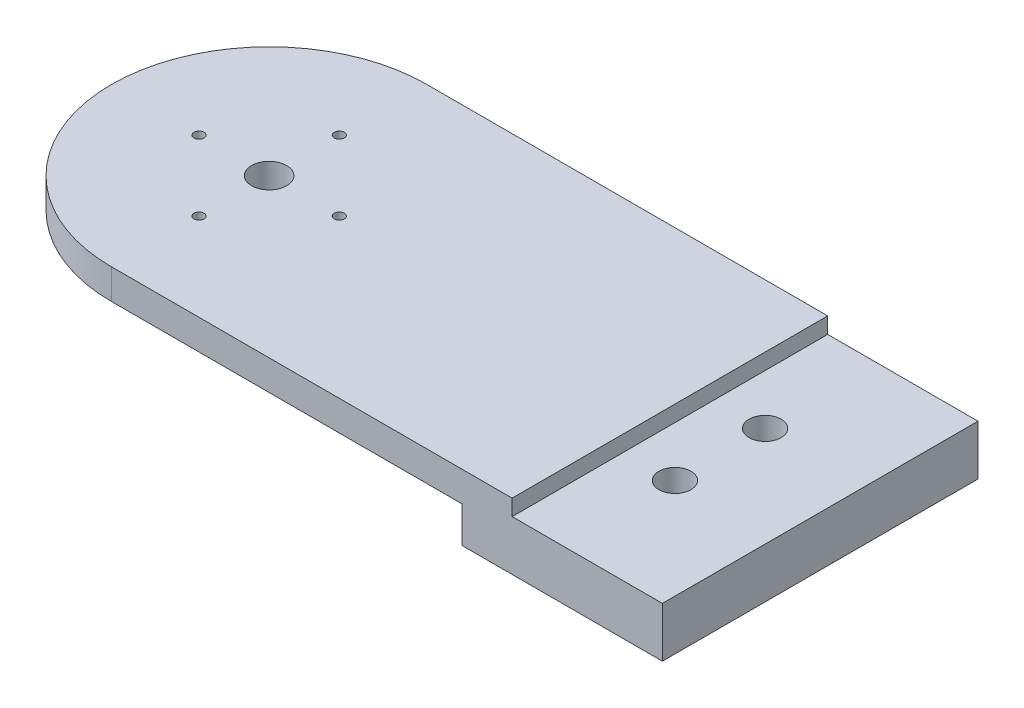
ISO-10303-21;
HEADER;
FILE_DESCRIPTION(('STEP AP214'),'2;1');
FILE_NAME('part.step','',(''),(''),'','','');
FILE_SCHEMA(('AUTOMOTIVE_DESIGN { 1 0 10303 214 1 1 1 1 }'));
ENDSEC;
DATA;
#1=APPLICATION_CONTEXT('core data for automotive mechanical design processes');
#2=APPLICATION_PROTOCOL_DEFINITION('international standard','automotive_design',2000,#1);
#3=PRODUCT_CONTEXT('',#1,'mechanical');
#4=PRODUCT('Part','Part','',(#3));
#5=PRODUCT_RELATED_PRODUCT_CATEGORY('part','',(#4));
#6=PRODUCT_DEFINITION_FORMATION('','',#4);
#7=PRODUCT_DEFINITION_CONTEXT('part definition',#1,'design');
#8=PRODUCT_DEFINITION('design','',#6,#7);
#9=PRODUCT_DEFINITION_SHAPE('','',#8);
#10=(LENGTH_UNIT() NAMED_UNIT(*) SI_UNIT(.MILLI.,.METRE.));
#11=(NAMED_UNIT(*) PLANE_ANGLE_UNIT() SI_UNIT($,.RADIAN.));
#12=(NAMED_UNIT(*) SI_UNIT($,.STERADIAN.) SOLID_ANGLE_UNIT());
#13=UNCERTAINTY_MEASURE_WITH_UNIT(LENGTH_MEASURE(1.E-05),#10,'distance_accuracy_value','');
#14=(GEOMETRIC_REPRESENTATION_CONTEXT(3) GLOBAL_UNCERTAINTY_ASSIGNED_CONTEXT((#13)) GLOBAL_UNIT_ASSIGNED_CONTEXT((#10,
#11,#12)) REPRESENTATION_CONTEXT('',''));
#15=CARTESIAN_POINT('',(0.,0.,0.));
#16=DIRECTION('',(0.,0.,1.));
#17=DIRECTION('',(1.,0.,0.));
#18=AXIS2_PLACEMENT_3D('',#15,#16,#17);
#19=CARTESIAN_POINT('',(0.,3.,0.));
#20=DIRECTION('',(0.,-1.,0.));
#21=DIRECTION('',(0.,0.,-1.));
#22=AXIS2_PLACEMENT_3D('',#19,#20,#21);
#23=CYLINDRICAL_SURFACE('',#22,15.75);
#24=CARTESIAN_POINT('',(0.,1.6,0.));
#25=DIRECTION('',(0.,-1.,0.));
#26=DIRECTION('',(0.,0.,-1.));
#27=AXIS2_PLACEMENT_3D('',#24,#25,#26);
#28=CIRCLE('',#27,15.75);
#29=CARTESIAN_POINT('',(0.,1.6,15.75));
#30=VERTEX_POINT('',#29);
#31=CARTESIAN_POINT('',(0.,1.6,-15.75));
#32=VERTEX_POINT('',#31);
#33=EDGE_CURVE('E146',#30,#32,#28,.T.);
#34=ORIENTED_EDGE('',*,*,#33,.F.);
#35=DIRECTION('',(0.,-1.,0.));
#36=VECTOR('',#35,1.);
#37=CARTESIAN_POINT('',(0.,3.,15.75));
#38=LINE('',#37,#36);
#39=CARTESIAN_POINT('',(0.,4.6,15.75));
#40=VERTEX_POINT('',#39);
#41=EDGE_CURVE('E11',#40,#30,#38,.T.);
#42=ORIENTED_EDGE('',*,*,#41,.F.);
#43=CARTESIAN_POINT('',(0.,4.6,0.));
#44=DIRECTION('',(0.,-1.,0.));
#45=DIRECTION('',(0.,0.,-1.));
#46=AXIS2_PLACEMENT_3D('',#43,#44,#45);
#47=CIRCLE('',#46,15.75);
#48=CARTESIAN_POINT('',(0.,4.6,-15.75));
#49=VERTEX_POINT('',#48);
#50=EDGE_CURVE('E115',#40,#49,#47,.T.);
#51=ORIENTED_EDGE('',*,*,#50,.T.);
#52=DIRECTION('',(0.,-1.,0.));
#53=VECTOR('',#52,1.);
#54=CARTESIAN_POINT('',(0.,3.,-15.75));
#55=LINE('',#54,#53);
#56=EDGE_CURVE('E109',#49,#32,#55,.T.);
#57=ORIENTED_EDGE('',*,*,#56,.T.);
#58=EDGE_LOOP('',(#34,#42,#51,#57));
#59=FACE_BOUND('',#58,.T.);
#60=ADVANCED_FACE('F39',(#59),#23,.T.);
#61=CARTESIAN_POINT('',(0.,3.,15.75));
#62=DIRECTION('',(0.,0.,-1.));
#63=DIRECTION('',(-1.,0.,0.));
#64=AXIS2_PLACEMENT_3D('',#61,#62,#63);
#65=PLANE('',#64);
#66=DIRECTION('',(1.,0.,0.));
#67=VECTOR('',#66,1.);
#68=CARTESIAN_POINT('',(0.,3.,15.75));
#69=LINE('',#68,#67);
#70=CARTESIAN_POINT('',(40.,3.,15.75));
#71=VERTEX_POINT('',#70);
#72=CARTESIAN_POINT('',(55.,3.,15.75));
#73=VERTEX_POINT('',#72);
#74=EDGE_CURVE('E175',#71,#73,#69,.T.);
#75=ORIENTED_EDGE('',*,*,#74,.F.);
#76=DIRECTION('',(0.,-1.,0.));
#77=VECTOR('',#76,1.);
#78=CARTESIAN_POINT('',(40.,4.6,15.75));
#79=LINE('',#78,#77);
#80=CARTESIAN_POINT('',(40.,4.6,15.75));
#81=VERTEX_POINT('',#80);
#82=EDGE_CURVE('E223',#81,#71,#79,.T.);
#83=ORIENTED_EDGE('',*,*,#82,.F.);
#84=DIRECTION('',(-1.,0.,0.));
#85=VECTOR('',#84,1.);
#86=CARTESIAN_POINT('',(35.,4.6,15.75));
#87=LINE('',#86,#85);
#88=EDGE_CURVE('E114',#81,#40,#87,.T.);
#89=ORIENTED_EDGE('',*,*,#88,.T.);
#90=ORIENTED_EDGE('',*,*,#41,.T.);
#91=DIRECTION('',(-1.,0.,0.));
#92=VECTOR('',#91,1.);
#93=CARTESIAN_POINT('',(35.,1.6,15.75));
#94=LINE('',#93,#92);
#95=CARTESIAN_POINT('',(35.,1.6,15.75));
#96=VERTEX_POINT('',#95);
#97=EDGE_CURVE('E144',#96,#30,#94,.T.);
#98=ORIENTED_EDGE('',*,*,#97,.F.);
#99=DIRECTION('',(0.,1.,0.));
#100=VECTOR('',#99,1.);
#101=CARTESIAN_POINT('',(35.,-2.,15.75));
#102=LINE('',#101,#100);
#103=CARTESIAN_POINT('',(35.,-2.,15.75));
#104=VERTEX_POINT('',#103);
#105=EDGE_CURVE('E171',#104,#96,#102,.T.);
#106=ORIENTED_EDGE('',*,*,#105,.F.);
#107=DIRECTION('',(-1.,0.,0.));
#108=VECTOR('',#107,1.);
#109=CARTESIAN_POINT('',(35.,-2.,15.75));
#110=LINE('',#109,#108);
#111=CARTESIAN_POINT('',(55.,-2.,15.75));
#112=VERTEX_POINT('',#111);
#113=EDGE_CURVE('E169',#112,#104,#110,.T.);
#114=ORIENTED_EDGE('',*,*,#113,.F.);
#115=DIRECTION('',(0.,-1.,0.));
#116=VECTOR('',#115,1.);
#117=CARTESIAN_POINT('',(55.,3.,15.75));
#118=LINE('',#117,#116);
#119=EDGE_CURVE('E47',#73,#112,#118,.T.);
#120=ORIENTED_EDGE('',*,*,#119,.F.);
#121=EDGE_LOOP('',(#75,#83,#89,#90,#98,#106,#114,#120));
#122=FACE_BOUND('',#121,.T.);
#123=ADVANCED_FACE('F225',(#122),#65,.F.);
#124=CARTESIAN_POINT('',(55.,3.,15.75));
#125=DIRECTION('',(-1.,0.,0.));
#126=DIRECTION('',(0.,0.,1.));
#127=AXIS2_PLACEMENT_3D('',#124,#125,#126);
#128=PLANE('',#127);
#129=ORIENTED_EDGE('',*,*,#119,.T.);
#130=DIRECTION('',(0.,0.,1.));
#131=VECTOR('',#130,1.);
#132=CARTESIAN_POINT('',(55.,-2.,15.75));
#133=LINE('',#132,#131);
#134=CARTESIAN_POINT('',(55.,-2.,-15.75));
#135=VERTEX_POINT('',#134);
#136=EDGE_CURVE('E166',#135,#112,#133,.T.);
#137=ORIENTED_EDGE('',*,*,#136,.F.);
#138=DIRECTION('',(0.,-1.,0.));
#139=VECTOR('',#138,1.);
#140=CARTESIAN_POINT('',(55.,3.,-15.75));
#141=LINE('',#140,#139);
#142=CARTESIAN_POINT('',(55.,3.,-15.75));
#143=VERTEX_POINT('',#142);
#144=EDGE_CURVE('E181',#143,#135,#141,.T.);
#145=ORIENTED_EDGE('',*,*,#144,.F.);
#146=DIRECTION('',(0.,0.,-1.));
#147=VECTOR('',#146,1.);
#148=CARTESIAN_POINT('',(55.,3.,15.75));
#149=LINE('',#148,#147);
#150=EDGE_CURVE('E177',#73,#143,#149,.T.);
#151=ORIENTED_EDGE('',*,*,#150,.F.);
#152=EDGE_LOOP('',(#129,#137,#145,#151));
#153=FACE_BOUND('',#152,.T.);
#154=ADVANCED_FACE('F234',(#153),#128,.F.);
#155=CARTESIAN_POINT('',(55.,3.,-15.75));
#156=DIRECTION('',(0.,0.,1.));
#157=DIRECTION('',(1.,0.,0.));
#158=AXIS2_PLACEMENT_3D('',#155,#156,#157);
#159=PLANE('',#158);
#160=DIRECTION('',(0.,1.,0.));
#161=VECTOR('',#160,1.);
#162=CARTESIAN_POINT('',(35.,-2.,-15.75));
#163=LINE('',#162,#161);
#164=CARTESIAN_POINT('',(35.,-2.,-15.75));
#165=VERTEX_POINT('',#164);
#166=CARTESIAN_POINT('',(35.,1.6,-15.75));
#167=VERTEX_POINT('',#166);
#168=EDGE_CURVE('E173',#165,#167,#163,.T.);
#169=ORIENTED_EDGE('',*,*,#168,.T.);
#170=DIRECTION('',(1.,0.,0.));
#171=VECTOR('',#170,1.);
#172=CARTESIAN_POINT('',(0.,1.6,-15.75));
#173=LINE('',#172,#171);
#174=EDGE_CURVE('E138',#32,#167,#173,.T.);
#175=ORIENTED_EDGE('',*,*,#174,.F.);
#176=ORIENTED_EDGE('',*,*,#56,.F.);
#177=DIRECTION('',(1.,0.,0.));
#178=VECTOR('',#177,1.);
#179=CARTESIAN_POINT('',(0.,4.6,-15.75));
#180=LINE('',#179,#178);
#181=CARTESIAN_POINT('',(40.,4.6,-15.75));
#182=VERTEX_POINT('',#181);
#183=EDGE_CURVE('E103',#49,#182,#180,.T.);
#184=ORIENTED_EDGE('',*,*,#183,.T.);
#185=DIRECTION('',(0.,1.,0.));
#186=VECTOR('',#185,1.);
#187=CARTESIAN_POINT('',(40.,4.6,-15.75));
#188=LINE('',#187,#186);
#189=CARTESIAN_POINT('',(40.,3.,-15.75));
#190=VERTEX_POINT('',#189);
#191=EDGE_CURVE('E106',#190,#182,#188,.T.);
#192=ORIENTED_EDGE('',*,*,#191,.F.);
#193=DIRECTION('',(-1.,0.,0.));
#194=VECTOR('',#193,1.);
#195=CARTESIAN_POINT('',(55.,3.,-15.75));
#196=LINE('',#195,#194);
#197=EDGE_CURVE('E55',#143,#190,#196,.T.);
#198=ORIENTED_EDGE('',*,*,#197,.F.);
#199=ORIENTED_EDGE('',*,*,#144,.T.);
#200=DIRECTION('',(1.,0.,0.));
#201=VECTOR('',#200,1.);
#202=CARTESIAN_POINT('',(35.,-2.,-15.75));
#203=LINE('',#202,#201);
#204=EDGE_CURVE('E163',#165,#135,#203,.T.);
#205=ORIENTED_EDGE('',*,*,#204,.F.);
#206=EDGE_LOOP('',(#169,#175,#176,#184,#192,#198,#199,#205));
#207=FACE_BOUND('',#206,.T.);
#208=ADVANCED_FACE('F105',(#207),#159,.F.);
#209=CARTESIAN_POINT('',(0.,3.,0.));
#210=DIRECTION('',(0.,1.,0.));
#211=DIRECTION('',(0.,0.,1.));
#212=AXIS2_PLACEMENT_3D('',#209,#210,#211);
#213=PLANE('',#212);
#214=DIRECTION('',(0.,0.,-1.));
#215=VECTOR('',#214,1.);
#216=CARTESIAN_POINT('',(40.,3.,15.75));
#217=LINE('',#216,#215);
#218=EDGE_CURVE('E59',#71,#190,#217,.T.);
#219=ORIENTED_EDGE('',*,*,#218,.F.);
#220=ORIENTED_EDGE('',*,*,#74,.T.);
#221=ORIENTED_EDGE('',*,*,#150,.T.);
#222=ORIENTED_EDGE('',*,*,#197,.T.);
#223=EDGE_LOOP('',(#219,#220,#221,#222));
#224=FACE_BOUND('',#223,.T.);
#225=CARTESIAN_POINT('',(45.0000000000004,3.,-4.49999999999967));
#226=DIRECTION('',(0.,1.,0.));
#227=DIRECTION('',(0.,0.,1.));
#228=AXIS2_PLACEMENT_3D('',#225,#226,#227);
#229=CIRCLE('',#228,1.5999999999998);
#230=CARTESIAN_POINT('',(45.0000000000004,3.,-2.89999999999987));
#231=VERTEX_POINT('',#230);
#232=EDGE_CURVE('E157',#231,#231,#229,.T.);
#233=ORIENTED_EDGE('',*,*,#232,.F.);
#234=EDGE_LOOP('',(#233));
#235=FACE_BOUND('',#234,.T.);
#236=CARTESIAN_POINT('',(45.0000000000004,3.,4.49999999999966));
#237=DIRECTION('',(0.,1.,0.));
#238=DIRECTION('',(0.,0.,1.));
#239=AXIS2_PLACEMENT_3D('',#236,#237,#238);
#240=CIRCLE('',#239,1.6);
#241=CARTESIAN_POINT('',(45.0000000000004,3.,6.09999999999966));
#242=VERTEX_POINT('',#241);
#243=EDGE_CURVE('E152',#242,#242,#240,.T.);
#244=ORIENTED_EDGE('',*,*,#243,.F.);
#245=EDGE_LOOP('',(#244));
#246=FACE_BOUND('',#245,.T.);
#247=ADVANCED_FACE('F229',(#224,#235,#246),#213,.T.);
#248=CARTESIAN_POINT('',(35.,-2.,15.75));
#249=DIRECTION('',(1.,0.,0.));
#250=DIRECTION('',(0.,0.,-1.));
#251=AXIS2_PLACEMENT_3D('',#248,#249,#250);
#252=PLANE('',#251);
#253=ORIENTED_EDGE('',*,*,#105,.T.);
#254=DIRECTION('',(0.,0.,1.));
#255=VECTOR('',#254,1.);
#256=CARTESIAN_POINT('',(35.,1.6,-15.75));
#257=LINE('',#256,#255);
#258=EDGE_CURVE('E141',#167,#96,#257,.T.);
#259=ORIENTED_EDGE('',*,*,#258,.F.);
#260=ORIENTED_EDGE('',*,*,#168,.F.);
#261=DIRECTION('',(0.,0.,-1.));
#262=VECTOR('',#261,1.);
#263=CARTESIAN_POINT('',(35.,-2.,15.75));
#264=LINE('',#263,#262);
#265=EDGE_CURVE('E160',#104,#165,#264,.T.);
#266=ORIENTED_EDGE('',*,*,#265,.F.);
#267=EDGE_LOOP('',(#253,#259,#260,#266));
#268=FACE_BOUND('',#267,.T.);
#269=ADVANCED_FACE('F242',(#268),#252,.F.);
#270=CARTESIAN_POINT('',(0.,-2.,0.));
#271=DIRECTION('',(0.,-1.,0.));
#272=DIRECTION('',(0.,0.,-1.));
#273=AXIS2_PLACEMENT_3D('',#270,#271,#272);
#274=PLANE('',#273);
#275=CARTESIAN_POINT('',(45.0000000000004,-2.,-4.49999999999967));
#276=DIRECTION('',(0.,-1.,0.));
#277=DIRECTION('',(0.,0.,-1.));
#278=AXIS2_PLACEMENT_3D('',#275,#276,#277);
#279=CIRCLE('',#278,1.5999999999998);
#280=CARTESIAN_POINT('',(45.0000000000004,-2.,-6.09999999999947));
#281=VERTEX_POINT('',#280);
#282=EDGE_CURVE('E149',#281,#281,#279,.T.);
#283=ORIENTED_EDGE('',*,*,#282,.F.);
#284=EDGE_LOOP('',(#283));
#285=FACE_BOUND('',#284,.T.);
#286=CARTESIAN_POINT('',(45.0000000000004,-2.,4.49999999999966));
#287=DIRECTION('',(0.,-1.,0.));
#288=DIRECTION('',(0.,0.,-1.));
#289=AXIS2_PLACEMENT_3D('',#286,#287,#288);
#290=CIRCLE('',#289,1.6);
#291=CARTESIAN_POINT('',(45.0000000000004,-2.,2.89999999999966));
#292=VERTEX_POINT('',#291);
#293=EDGE_CURVE('E148',#292,#292,#290,.T.);
#294=ORIENTED_EDGE('',*,*,#293,.F.);
#295=EDGE_LOOP('',(#294));
#296=FACE_BOUND('',#295,.T.);
#297=ORIENTED_EDGE('',*,*,#265,.T.);
#298=ORIENTED_EDGE('',*,*,#204,.T.);
#299=ORIENTED_EDGE('',*,*,#136,.T.);
#300=ORIENTED_EDGE('',*,*,#113,.T.);
#301=EDGE_LOOP('',(#297,#298,#299,#300));
#302=FACE_BOUND('',#301,.T.);
#303=ADVANCED_FACE('F236',(#285,#296,#302),#274,.T.);
#304=CARTESIAN_POINT('',(45.0000000000004,8.,4.49999999999966));
#305=DIRECTION('',(0.,-1.,0.));
#306=DIRECTION('',(0.,0.,-1.));
#307=AXIS2_PLACEMENT_3D('',#304,#305,#306);
#308=CYLINDRICAL_SURFACE('',#307,1.6);
#309=ORIENTED_EDGE('',*,*,#243,.T.);
#310=EDGE_LOOP('',(#309));
#311=FACE_BOUND('',#310,.T.);
#312=ORIENTED_EDGE('',*,*,#293,.T.);
#313=EDGE_LOOP('',(#312));
#314=FACE_BOUND('',#313,.T.);
#315=ADVANCED_FACE('F258',(#311,#314),#308,.F.);
#316=CARTESIAN_POINT('',(45.0000000000004,8.,-4.49999999999967));
#317=DIRECTION('',(0.,-1.,0.));
#318=DIRECTION('',(0.,0.,-1.));
#319=AXIS2_PLACEMENT_3D('',#316,#317,#318);
#320=CYLINDRICAL_SURFACE('',#319,1.5999999999998);
#321=ORIENTED_EDGE('',*,*,#232,.T.);
#322=EDGE_LOOP('',(#321));
#323=FACE_BOUND('',#322,.T.);
#324=ORIENTED_EDGE('',*,*,#282,.T.);
#325=EDGE_LOOP('',(#324));
#326=FACE_BOUND('',#325,.T.);
#327=ADVANCED_FACE('F249',(#323,#326),#320,.F.);
#328=CARTESIAN_POINT('',(0.,1.6,0.));
#329=DIRECTION('',(0.,-1.,0.));
#330=DIRECTION('',(0.,0.,-1.));
#331=AXIS2_PLACEMENT_3D('',#328,#329,#330);
#332=PLANE('',#331);
#333=CARTESIAN_POINT('',(0.,1.6,0.));
#334=DIRECTION('',(0.,-1.,0.));
#335=DIRECTION('',(0.,0.,-1.));
#336=AXIS2_PLACEMENT_3D('',#333,#334,#335);
#337=CIRCLE('',#336,10.);
#338=CARTESIAN_POINT('',(0.,1.6,-10.));
#339=VERTEX_POINT('',#338);
#340=EDGE_CURVE('E126',#339,#339,#337,.T.);
#341=ORIENTED_EDGE('',*,*,#340,.F.);
#342=EDGE_LOOP('',(#341));
#343=FACE_BOUND('',#342,.T.);
#344=ORIENTED_EDGE('',*,*,#174,.T.);
#345=ORIENTED_EDGE('',*,*,#258,.T.);
#346=ORIENTED_EDGE('',*,*,#97,.T.);
#347=ORIENTED_EDGE('',*,*,#33,.T.);
#348=EDGE_LOOP('',(#344,#345,#346,#347));
#349=FACE_BOUND('',#348,.T.);
#350=ADVANCED_FACE('F247',(#343,#349),#332,.T.);
#351=CARTESIAN_POINT('',(0.,4.6,0.));
#352=DIRECTION('',(0.,-1.,0.));
#353=DIRECTION('',(0.,0.,-1.));
#354=AXIS2_PLACEMENT_3D('',#351,#352,#353);
#355=PLANE('',#354);
#356=CARTESIAN_POINT('',(0.,4.6,7.));
#357=DIRECTION('',(0.,-1.,0.));
#358=DIRECTION('',(0.,0.,-1.));
#359=AXIS2_PLACEMENT_3D('',#356,#357,#358);
#360=CIRCLE('',#359,0.5);
#361=CARTESIAN_POINT('',(0.,4.6,6.5));
#362=VERTEX_POINT('',#361);
#363=EDGE_CURVE('E42',#362,#362,#360,.T.);
#364=ORIENTED_EDGE('',*,*,#363,.T.);
#365=EDGE_LOOP('',(#364));
#366=FACE_BOUND('',#365,.T.);
#367=CARTESIAN_POINT('',(7.,4.6,0.));
#368=DIRECTION('',(0.,-1.,0.));
#369=DIRECTION('',(0.,0.,-1.));
#370=AXIS2_PLACEMENT_3D('',#367,#368,#369);
#371=CIRCLE('',#370,0.5);
#372=CARTESIAN_POINT('',(7.,4.6,-0.5));
#373=VERTEX_POINT('',#372);
#374=EDGE_CURVE('E191',#373,#373,#371,.T.);
#375=ORIENTED_EDGE('',*,*,#374,.T.);
#376=EDGE_LOOP('',(#375));
#377=FACE_BOUND('',#376,.T.);
#378=CARTESIAN_POINT('',(0.,4.6,-7.));
#379=DIRECTION('',(0.,-1.,0.));
#380=DIRECTION('',(0.,0.,-1.));
#381=AXIS2_PLACEMENT_3D('',#378,#379,#380);
#382=CIRCLE('',#381,0.5);
#383=CARTESIAN_POINT('',(0.,4.6,-7.5));
#384=VERTEX_POINT('',#383);
#385=EDGE_CURVE('E189',#384,#384,#382,.T.);
#386=ORIENTED_EDGE('',*,*,#385,.T.);
#387=EDGE_LOOP('',(#386));
#388=FACE_BOUND('',#387,.T.);
#389=CARTESIAN_POINT('',(-7.,4.6,0.));
#390=DIRECTION('',(0.,-1.,0.));
#391=DIRECTION('',(0.,0.,-1.));
#392=AXIS2_PLACEMENT_3D('',#389,#390,#391);
#393=CIRCLE('',#392,0.500000000000001);
#394=CARTESIAN_POINT('',(-7.,4.6,-0.500000000000001));
#395=VERTEX_POINT('',#394);
#396=EDGE_CURVE('E186',#395,#395,#393,.T.);
#397=ORIENTED_EDGE('',*,*,#396,.T.);
#398=EDGE_LOOP('',(#397));
#399=FACE_BOUND('',#398,.T.);
#400=CARTESIAN_POINT('',(0.,4.6,0.));
#401=DIRECTION('',(0.,-1.,0.));
#402=DIRECTION('',(0.,0.,-1.));
#403=AXIS2_PLACEMENT_3D('',#400,#401,#402);
#404=CIRCLE('',#403,1.75);
#405=CARTESIAN_POINT('',(0.,4.6,-1.75));
#406=VERTEX_POINT('',#405);
#407=EDGE_CURVE('E134',#406,#406,#404,.T.);
#408=ORIENTED_EDGE('',*,*,#407,.T.);
#409=EDGE_LOOP('',(#408));
#410=FACE_BOUND('',#409,.T.);
#411=ORIENTED_EDGE('',*,*,#50,.F.);
#412=ORIENTED_EDGE('',*,*,#88,.F.);
#413=DIRECTION('',(0.,0.,1.));
#414=VECTOR('',#413,1.);
#415=CARTESIAN_POINT('',(40.,4.6,15.75));
#416=LINE('',#415,#414);
#417=EDGE_CURVE('E121',#182,#81,#416,.T.);
#418=ORIENTED_EDGE('',*,*,#417,.F.);
#419=ORIENTED_EDGE('',*,*,#183,.F.);
#420=EDGE_LOOP('',(#411,#412,#418,#419));
#421=FACE_BOUND('',#420,.T.);
#422=ADVANCED_FACE('F124',(#366,#377,#388,#399,#410,#421),#355,.F.);
#423=CARTESIAN_POINT('',(0.,11.6,0.));
#424=DIRECTION('',(0.,-1.,0.));
#425=DIRECTION('',(0.,0.,-1.));
#426=AXIS2_PLACEMENT_3D('',#423,#424,#425);
#427=CYLINDRICAL_SURFACE('',#426,1.75);
#428=ORIENTED_EDGE('',*,*,#407,.F.);
#429=EDGE_LOOP('',(#428));
#430=FACE_BOUND('',#429,.T.);
#431=CARTESIAN_POINT('',(0.,0.,0.));
#432=DIRECTION('',(0.,-1.,0.));
#433=DIRECTION('',(0.,0.,-1.));
#434=AXIS2_PLACEMENT_3D('',#431,#432,#433);
#435=CIRCLE('',#434,1.75);
#436=CARTESIAN_POINT('',(0.,0.,-1.75));
#437=VERTEX_POINT('',#436);
#438=EDGE_CURVE('E219',#437,#437,#435,.T.);
#439=ORIENTED_EDGE('',*,*,#438,.T.);
#440=EDGE_LOOP('',(#439));
#441=FACE_BOUND('',#440,.T.);
#442=ADVANCED_FACE('F256',(#430,#441),#427,.F.);
#443=CARTESIAN_POINT('',(-7.,11.6,0.));
#444=DIRECTION('',(0.,-1.,0.));
#445=DIRECTION('',(0.,0.,-1.));
#446=AXIS2_PLACEMENT_3D('',#443,#444,#445);
#447=CYLINDRICAL_SURFACE('',#446,0.500000000000001);
#448=ORIENTED_EDGE('',*,*,#396,.F.);
#449=EDGE_LOOP('',(#448));
#450=FACE_BOUND('',#449,.T.);
#451=CARTESIAN_POINT('',(-7.,0.,0.));
#452=DIRECTION('',(0.,-1.,0.));
#453=DIRECTION('',(0.,0.,-1.));
#454=AXIS2_PLACEMENT_3D('',#451,#452,#453);
#455=CIRCLE('',#454,0.500000000000001);
#456=CARTESIAN_POINT('',(-7.,0.,-0.500000000000001));
#457=VERTEX_POINT('',#456);
#458=EDGE_CURVE('E210',#457,#457,#455,.T.);
#459=ORIENTED_EDGE('',*,*,#458,.T.);
#460=EDGE_LOOP('',(#459));
#461=FACE_BOUND('',#460,.T.);
#462=ADVANCED_FACE('F367',(#450,#461),#447,.F.);
#463=CARTESIAN_POINT('',(0.,11.6,-7.));
#464=DIRECTION('',(0.,-1.,0.));
#465=DIRECTION('',(0.,0.,-1.));
#466=AXIS2_PLACEMENT_3D('',#463,#464,#465);
#467=CYLINDRICAL_SURFACE('',#466,0.5);
#468=ORIENTED_EDGE('',*,*,#385,.F.);
#469=EDGE_LOOP('',(#468));
#470=FACE_BOUND('',#469,.T.);
#471=CARTESIAN_POINT('',(0.,0.,-7.));
#472=DIRECTION('',(0.,-1.,0.));
#473=DIRECTION('',(0.,0.,-1.));
#474=AXIS2_PLACEMENT_3D('',#471,#472,#473);
#475=CIRCLE('',#474,0.5);
#476=CARTESIAN_POINT('',(0.,0.,-7.5));
#477=VERTEX_POINT('',#476);
#478=EDGE_CURVE('E209',#477,#477,#475,.T.);
#479=ORIENTED_EDGE('',*,*,#478,.T.);
#480=EDGE_LOOP('',(#479));
#481=FACE_BOUND('',#480,.T.);
#482=ADVANCED_FACE('F378',(#470,#481),#467,.F.);
#483=CARTESIAN_POINT('',(7.,11.6,0.));
#484=DIRECTION('',(0.,-1.,0.));
#485=DIRECTION('',(0.,0.,-1.));
#486=AXIS2_PLACEMENT_3D('',#483,#484,#485);
#487=CYLINDRICAL_SURFACE('',#486,0.5);
#488=ORIENTED_EDGE('',*,*,#374,.F.);
#489=EDGE_LOOP('',(#488));
#490=FACE_BOUND('',#489,.T.);
#491=CARTESIAN_POINT('',(7.,0.,0.));
#492=DIRECTION('',(0.,-1.,0.));
#493=DIRECTION('',(0.,0.,-1.));
#494=AXIS2_PLACEMENT_3D('',#491,#492,#493);
#495=CIRCLE('',#494,0.500000000000001);
#496=CARTESIAN_POINT('',(7.,0.,-0.500000000000001));
#497=VERTEX_POINT('',#496);
#498=EDGE_CURVE('E213',#497,#497,#495,.T.);
#499=ORIENTED_EDGE('',*,*,#498,.T.);
#500=EDGE_LOOP('',(#499));
#501=FACE_BOUND('',#500,.T.);
#502=ADVANCED_FACE('F203',(#490,#501),#487,.F.);
#503=CARTESIAN_POINT('',(0.,11.6,7.));
#504=DIRECTION('',(0.,-1.,0.));
#505=DIRECTION('',(0.,0.,-1.));
#506=AXIS2_PLACEMENT_3D('',#503,#504,#505);
#507=CYLINDRICAL_SURFACE('',#506,0.5);
#508=ORIENTED_EDGE('',*,*,#363,.F.);
#509=EDGE_LOOP('',(#508));
#510=FACE_BOUND('',#509,.T.);
#511=CARTESIAN_POINT('',(0.,0.,7.));
#512=DIRECTION('',(0.,-1.,0.));
#513=DIRECTION('',(0.,0.,-1.));
#514=AXIS2_PLACEMENT_3D('',#511,#512,#513);
#515=CIRCLE('',#514,0.5);
#516=CARTESIAN_POINT('',(0.,0.,6.5));
#517=VERTEX_POINT('',#516);
#518=EDGE_CURVE('E207',#517,#517,#515,.T.);
#519=ORIENTED_EDGE('',*,*,#518,.T.);
#520=EDGE_LOOP('',(#519));
#521=FACE_BOUND('',#520,.T.);
#522=ADVANCED_FACE('F199',(#510,#521),#507,.F.);
#523=CARTESIAN_POINT('',(0.,0.,0.));
#524=DIRECTION('',(0.,1.,0.));
#525=DIRECTION('',(0.,0.,1.));
#526=AXIS2_PLACEMENT_3D('',#523,#524,#525);
#527=CYLINDRICAL_SURFACE('',#526,10.);
#528=CARTESIAN_POINT('',(0.,0.,0.));
#529=DIRECTION('',(0.,-1.,0.));
#530=DIRECTION('',(0.,0.,-1.));
#531=AXIS2_PLACEMENT_3D('',#528,#529,#530);
#532=CIRCLE('',#531,10.);
#533=CARTESIAN_POINT('',(0.,0.,-10.));
#534=VERTEX_POINT('',#533);
#535=EDGE_CURVE('E129',#534,#534,#532,.T.);
#536=ORIENTED_EDGE('',*,*,#535,.F.);
#537=EDGE_LOOP('',(#536));
#538=FACE_BOUND('',#537,.T.);
#539=ORIENTED_EDGE('',*,*,#340,.T.);
#540=EDGE_LOOP('',(#539));
#541=FACE_BOUND('',#540,.T.);
#542=ADVANCED_FACE('F202',(#538,#541),#527,.T.);
#543=CARTESIAN_POINT('',(0.,0.,0.));
#544=DIRECTION('',(0.,-1.,0.));
#545=DIRECTION('',(0.,0.,-1.));
#546=AXIS2_PLACEMENT_3D('',#543,#544,#545);
#547=PLANE('',#546);
#548=ORIENTED_EDGE('',*,*,#498,.F.);
#549=EDGE_LOOP('',(#548));
#550=FACE_BOUND('',#549,.T.);
#551=ORIENTED_EDGE('',*,*,#478,.F.);
#552=EDGE_LOOP('',(#551));
#553=FACE_BOUND('',#552,.T.);
#554=ORIENTED_EDGE('',*,*,#518,.F.);
#555=EDGE_LOOP('',(#554));
#556=FACE_BOUND('',#555,.T.);
#557=ORIENTED_EDGE('',*,*,#458,.F.);
#558=EDGE_LOOP('',(#557));
#559=FACE_BOUND('',#558,.T.);
#560=ORIENTED_EDGE('',*,*,#438,.F.);
#561=EDGE_LOOP('',(#560));
#562=FACE_BOUND('',#561,.T.);
#563=ORIENTED_EDGE('',*,*,#535,.T.);
#564=EDGE_LOOP('',(#563));
#565=FACE_BOUND('',#564,.T.);
#566=ADVANCED_FACE('F322',(#550,#553,#556,#559,#562,#565),#547,.T.);
#567=CARTESIAN_POINT('',(40.,0.,0.));
#568=DIRECTION('',(1.,0.,0.));
#569=DIRECTION('',(0.,0.,-1.));
#570=AXIS2_PLACEMENT_3D('',#567,#568,#569);
#571=PLANE('',#570);
#572=ORIENTED_EDGE('',*,*,#82,.T.);
#573=ORIENTED_EDGE('',*,*,#218,.T.);
#574=ORIENTED_EDGE('',*,*,#191,.T.);
#575=ORIENTED_EDGE('',*,*,#417,.T.);
#576=EDGE_LOOP('',(#572,#573,#574,#575));
#577=FACE_BOUND('',#576,.T.);
#578=ADVANCED_FACE('F120',(#577),#571,.T.);
#579=CLOSED_SHELL('',(#60,#123,#154,#208,#247,#269,#303,#315,#327,#350,#422,#442,#462,#482,#502,
#522,#542,#566,#578));
#580=MANIFOLD_SOLID_BREP('B2',#579);
#581=ADVANCED_BREP_SHAPE_REPRESENTATION('',(#18,#580),#14);
#582=SHAPE_DEFINITION_REPRESENTATION(#9,#581);
ENDSEC;
END-ISO-10303-21;
